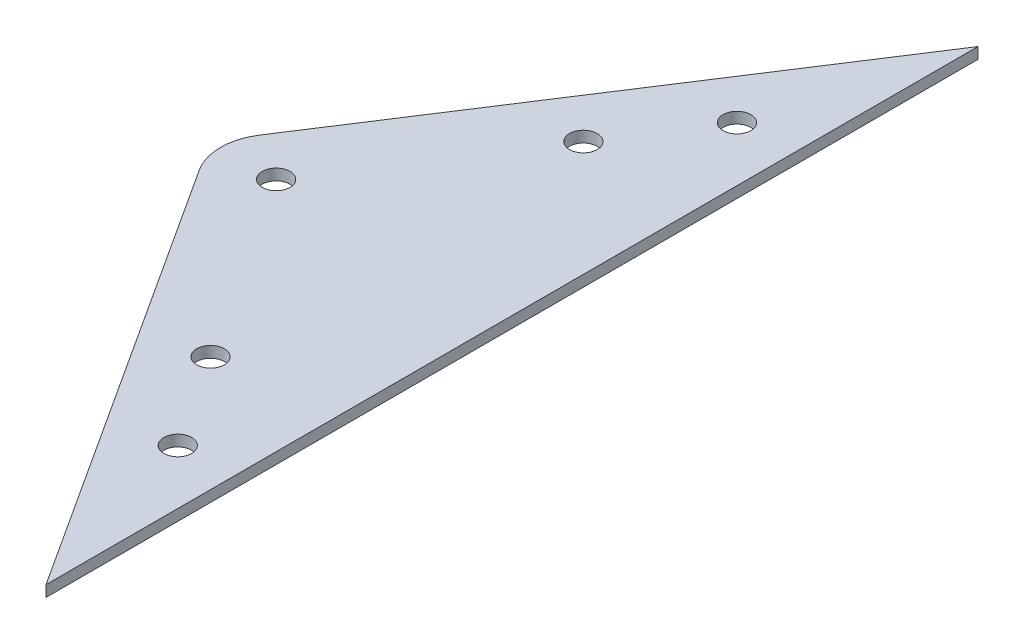
ISO-10303-21;
HEADER;
FILE_DESCRIPTION(('STEP AP214'),'2;1');
FILE_NAME('part.step','',(''),(''),'','','');
FILE_SCHEMA(('AUTOMOTIVE_DESIGN { 1 0 10303 214 1 1 1 1 }'));
ENDSEC;
DATA;
#1=APPLICATION_CONTEXT('core data for automotive mechanical design processes');
#2=APPLICATION_PROTOCOL_DEFINITION('international standard','automotive_design',2000,#1);
#3=PRODUCT_CONTEXT('',#1,'mechanical');
#4=PRODUCT('Part','Part','',(#3));
#5=PRODUCT_RELATED_PRODUCT_CATEGORY('part','',(#4));
#6=PRODUCT_DEFINITION_FORMATION('','',#4);
#7=PRODUCT_DEFINITION_CONTEXT('part definition',#1,'design');
#8=PRODUCT_DEFINITION('design','',#6,#7);
#9=PRODUCT_DEFINITION_SHAPE('','',#8);
#10=(LENGTH_UNIT() NAMED_UNIT(*) SI_UNIT(.MILLI.,.METRE.));
#11=(NAMED_UNIT(*) PLANE_ANGLE_UNIT() SI_UNIT($,.RADIAN.));
#12=(NAMED_UNIT(*) SI_UNIT($,.STERADIAN.) SOLID_ANGLE_UNIT());
#13=UNCERTAINTY_MEASURE_WITH_UNIT(LENGTH_MEASURE(1.E-05),#10,'distance_accuracy_value','');
#14=(GEOMETRIC_REPRESENTATION_CONTEXT(3) GLOBAL_UNCERTAINTY_ASSIGNED_CONTEXT((#13)) GLOBAL_UNIT_ASSIGNED_CONTEXT((#10,
#11,#12)) REPRESENTATION_CONTEXT('',''));
#15=CARTESIAN_POINT('',(0.,0.,0.));
#16=DIRECTION('',(0.,0.,1.));
#17=DIRECTION('',(1.,0.,0.));
#18=AXIS2_PLACEMENT_3D('',#15,#16,#17);
#19=CARTESIAN_POINT('',(72.122454047168,2.,378.693529571852));
#20=DIRECTION('',(0.,1.,0.));
#21=DIRECTION('',(0.,0.,1.));
#22=AXIS2_PLACEMENT_3D('',#19,#20,#21);
#23=PLANE('',#22);
#24=CARTESIAN_POINT('',(93.878732030658,2.,412.259351002365));
#25=DIRECTION('',(0.,1.,0.));
#26=DIRECTION('',(0.,0.,1.));
#27=AXIS2_PLACEMENT_3D('',#24,#25,#26);
#28=CIRCLE('',#27,2.50000000000004);
#29=CARTESIAN_POINT('',(93.878732030658,2.,414.759351002365));
#30=VERTEX_POINT('',#29);
#31=EDGE_CURVE('E127',#30,#30,#28,.T.);
#32=ORIENTED_EDGE('',*,*,#31,.F.);
#33=EDGE_LOOP('',(#32));
#34=FACE_BOUND('',#33,.T.);
#35=CARTESIAN_POINT('',(93.8787320306581,2.,345.127708141339));
#36=DIRECTION('',(0.,1.,0.));
#37=DIRECTION('',(0.,0.,1.));
#38=AXIS2_PLACEMENT_3D('',#35,#36,#37);
#39=CIRCLE('',#38,2.50000000000008);
#40=CARTESIAN_POINT('',(93.8787320306581,2.,347.627708141339));
#41=VERTEX_POINT('',#40);
#42=EDGE_CURVE('E115',#41,#41,#39,.T.);
#43=ORIENTED_EDGE('',*,*,#42,.F.);
#44=EDGE_LOOP('',(#43));
#45=FACE_BOUND('',#44,.T.);
#46=DIRECTION('',(0.,0.,-1.));
#47=VECTOR('',#46,1.);
#48=CARTESIAN_POINT('',(114.596265016384,2.,294.778975995569));
#49=LINE('',#48,#47);
#50=CARTESIAN_POINT('',(114.596265016384,2.,462.608083148135));
#51=VERTEX_POINT('',#50);
#52=CARTESIAN_POINT('',(114.596265016384,2.,294.778975995569));
#53=VERTEX_POINT('',#52);
#54=EDGE_CURVE('E85',#51,#53,#49,.T.);
#55=ORIENTED_EDGE('',*,*,#54,.T.);
#56=DIRECTION('',(-0.543906949587252,0.,0.839145535762832));
#57=VECTOR('',#56,1.);
#58=CARTESIAN_POINT('',(63.7309986895397,2.,373.25446007598));
#59=LINE('',#58,#57);
#60=CARTESIAN_POINT('',(63.7309986895397,2.,373.25446007598));
#61=VERTEX_POINT('',#60);
#62=EDGE_CURVE('E80',#53,#61,#59,.T.);
#63=ORIENTED_EDGE('',*,*,#62,.T.);
#64=CARTESIAN_POINT('',(72.122454047168,2.,378.693529571852));
#65=DIRECTION('',(0.,1.,0.));
#66=DIRECTION('',(0.,0.,1.));
#67=AXIS2_PLACEMENT_3D('',#64,#65,#66);
#68=CIRCLE('',#67,10.);
#69=CARTESIAN_POINT('',(63.7309986895397,2.,384.132599067725));
#70=VERTEX_POINT('',#69);
#71=EDGE_CURVE('E83',#61,#70,#68,.T.);
#72=ORIENTED_EDGE('',*,*,#71,.T.);
#73=DIRECTION('',(0.543906949587253,0.,0.839145535762832));
#74=VECTOR('',#73,1.);
#75=CARTESIAN_POINT('',(114.596265016384,2.,462.608083148135));
#76=LINE('',#75,#74);
#77=EDGE_CURVE('E50',#70,#51,#76,.T.);
#78=ORIENTED_EDGE('',*,*,#77,.T.);
#79=EDGE_LOOP('',(#55,#63,#72,#78));
#80=FACE_BOUND('',#79,.T.);
#81=CARTESIAN_POINT('',(72.122454047168,2.,378.693529571852));
#82=DIRECTION('',(0.,1.,0.));
#83=DIRECTION('',(0.,0.,1.));
#84=AXIS2_PLACEMENT_3D('',#81,#82,#83);
#85=CIRCLE('',#84,2.50000000000002);
#86=CARTESIAN_POINT('',(72.122454047168,2.,381.193529571852));
#87=VERTEX_POINT('',#86);
#88=EDGE_CURVE('E100',#87,#87,#85,.T.);
#89=ORIENTED_EDGE('',*,*,#88,.F.);
#90=EDGE_LOOP('',(#89));
#91=FACE_BOUND('',#90,.T.);
#92=CARTESIAN_POINT('',(104.756871022403,2.,328.344797426082));
#93=DIRECTION('',(0.,1.,0.));
#94=DIRECTION('',(0.,0.,1.));
#95=AXIS2_PLACEMENT_3D('',#92,#93,#94);
#96=CIRCLE('',#95,2.50000000000005);
#97=CARTESIAN_POINT('',(104.756871022403,2.,330.844797426082));
#98=VERTEX_POINT('',#97);
#99=EDGE_CURVE('E121',#98,#98,#96,.T.);
#100=ORIENTED_EDGE('',*,*,#99,.F.);
#101=EDGE_LOOP('',(#100));
#102=FACE_BOUND('',#101,.T.);
#103=CARTESIAN_POINT('',(104.756871022403,2.,429.042261717622));
#104=DIRECTION('',(0.,1.,0.));
#105=DIRECTION('',(0.,0.,1.));
#106=AXIS2_PLACEMENT_3D('',#103,#104,#105);
#107=CIRCLE('',#106,2.50000000000005);
#108=CARTESIAN_POINT('',(104.756871022403,2.,431.542261717622));
#109=VERTEX_POINT('',#108);
#110=EDGE_CURVE('E133',#109,#109,#107,.T.);
#111=ORIENTED_EDGE('',*,*,#110,.F.);
#112=EDGE_LOOP('',(#111));
#113=FACE_BOUND('',#112,.T.);
#114=ADVANCED_FACE('F33',(#34,#45,#80,#91,#102,#113),#23,.T.);
#115=CARTESIAN_POINT('',(72.122454047168,0.,378.693529571852));
#116=DIRECTION('',(0.,1.,0.));
#117=DIRECTION('',(0.,0.,1.));
#118=AXIS2_PLACEMENT_3D('',#115,#116,#117);
#119=PLANE('',#118);
#120=DIRECTION('',(0.,0.,-1.));
#121=VECTOR('',#120,1.);
#122=CARTESIAN_POINT('',(114.596265016384,0.,294.778975995569));
#123=LINE('',#122,#121);
#124=CARTESIAN_POINT('',(114.596265016384,0.,462.608083148135));
#125=VERTEX_POINT('',#124);
#126=CARTESIAN_POINT('',(114.596265016384,0.,294.778975995569));
#127=VERTEX_POINT('',#126);
#128=EDGE_CURVE('E97',#125,#127,#123,.T.);
#129=ORIENTED_EDGE('',*,*,#128,.F.);
#130=DIRECTION('',(0.543906949587253,0.,0.839145535762832));
#131=VECTOR('',#130,1.);
#132=CARTESIAN_POINT('',(114.596265016384,0.,462.608083148135));
#133=LINE('',#132,#131);
#134=CARTESIAN_POINT('',(63.7309986895397,0.,384.132599067725));
#135=VERTEX_POINT('',#134);
#136=EDGE_CURVE('E73',#135,#125,#133,.T.);
#137=ORIENTED_EDGE('',*,*,#136,.F.);
#138=CARTESIAN_POINT('',(72.122454047168,0.,378.693529571852));
#139=DIRECTION('',(0.,1.,0.));
#140=DIRECTION('',(0.,0.,1.));
#141=AXIS2_PLACEMENT_3D('',#138,#139,#140);
#142=CIRCLE('',#141,10.);
#143=CARTESIAN_POINT('',(63.7309986895397,0.,373.25446007598));
#144=VERTEX_POINT('',#143);
#145=EDGE_CURVE('E67',#144,#135,#142,.T.);
#146=ORIENTED_EDGE('',*,*,#145,.F.);
#147=DIRECTION('',(-0.543906949587252,0.,0.839145535762832));
#148=VECTOR('',#147,1.);
#149=CARTESIAN_POINT('',(63.7309986895397,0.,373.25446007598));
#150=LINE('',#149,#148);
#151=EDGE_CURVE('E89',#127,#144,#150,.T.);
#152=ORIENTED_EDGE('',*,*,#151,.F.);
#153=EDGE_LOOP('',(#129,#137,#146,#152));
#154=FACE_BOUND('',#153,.T.);
#155=CARTESIAN_POINT('',(72.122454047168,0.,378.693529571852));
#156=DIRECTION('',(0.,1.,0.));
#157=DIRECTION('',(0.,0.,1.));
#158=AXIS2_PLACEMENT_3D('',#155,#156,#157);
#159=CIRCLE('',#158,2.50000000000002);
#160=CARTESIAN_POINT('',(72.122454047168,0.,381.193529571852));
#161=VERTEX_POINT('',#160);
#162=EDGE_CURVE('E112',#161,#161,#159,.T.);
#163=ORIENTED_EDGE('',*,*,#162,.T.);
#164=EDGE_LOOP('',(#163));
#165=FACE_BOUND('',#164,.T.);
#166=CARTESIAN_POINT('',(93.8787320306581,0.,345.127708141339));
#167=DIRECTION('',(0.,1.,0.));
#168=DIRECTION('',(0.,0.,1.));
#169=AXIS2_PLACEMENT_3D('',#166,#167,#168);
#170=CIRCLE('',#169,2.50000000000008);
#171=CARTESIAN_POINT('',(93.8787320306581,0.,347.627708141339));
#172=VERTEX_POINT('',#171);
#173=EDGE_CURVE('E118',#172,#172,#170,.T.);
#174=ORIENTED_EDGE('',*,*,#173,.T.);
#175=EDGE_LOOP('',(#174));
#176=FACE_BOUND('',#175,.T.);
#177=CARTESIAN_POINT('',(104.756871022403,0.,328.344797426082));
#178=DIRECTION('',(0.,1.,0.));
#179=DIRECTION('',(0.,0.,1.));
#180=AXIS2_PLACEMENT_3D('',#177,#178,#179);
#181=CIRCLE('',#180,2.50000000000005);
#182=CARTESIAN_POINT('',(104.756871022403,0.,330.844797426082));
#183=VERTEX_POINT('',#182);
#184=EDGE_CURVE('E124',#183,#183,#181,.T.);
#185=ORIENTED_EDGE('',*,*,#184,.T.);
#186=EDGE_LOOP('',(#185));
#187=FACE_BOUND('',#186,.T.);
#188=CARTESIAN_POINT('',(93.878732030658,0.,412.259351002365));
#189=DIRECTION('',(0.,1.,0.));
#190=DIRECTION('',(0.,0.,1.));
#191=AXIS2_PLACEMENT_3D('',#188,#189,#190);
#192=CIRCLE('',#191,2.50000000000004);
#193=CARTESIAN_POINT('',(93.878732030658,0.,414.759351002365));
#194=VERTEX_POINT('',#193);
#195=EDGE_CURVE('E130',#194,#194,#192,.T.);
#196=ORIENTED_EDGE('',*,*,#195,.T.);
#197=EDGE_LOOP('',(#196));
#198=FACE_BOUND('',#197,.T.);
#199=CARTESIAN_POINT('',(104.756871022403,0.,429.042261717622));
#200=DIRECTION('',(0.,1.,0.));
#201=DIRECTION('',(0.,0.,1.));
#202=AXIS2_PLACEMENT_3D('',#199,#200,#201);
#203=CIRCLE('',#202,2.50000000000005);
#204=CARTESIAN_POINT('',(104.756871022403,0.,431.542261717622));
#205=VERTEX_POINT('',#204);
#206=EDGE_CURVE('E136',#205,#205,#203,.T.);
#207=ORIENTED_EDGE('',*,*,#206,.T.);
#208=EDGE_LOOP('',(#207));
#209=FACE_BOUND('',#208,.T.);
#210=ADVANCED_FACE('F108',(#154,#165,#176,#187,#198,#209),#119,.F.);
#211=CARTESIAN_POINT('',(114.596265016384,2.,294.778975995569));
#212=DIRECTION('',(-1.,0.,0.));
#213=DIRECTION('',(0.,0.,1.));
#214=AXIS2_PLACEMENT_3D('',#211,#212,#213);
#215=PLANE('',#214);
#216=ORIENTED_EDGE('',*,*,#128,.T.);
#217=DIRECTION('',(0.,-1.,0.));
#218=VECTOR('',#217,1.);
#219=CARTESIAN_POINT('',(114.596265016384,2.,294.778975995569));
#220=LINE('',#219,#218);
#221=EDGE_CURVE('E11',#53,#127,#220,.T.);
#222=ORIENTED_EDGE('',*,*,#221,.F.);
#223=ORIENTED_EDGE('',*,*,#54,.F.);
#224=DIRECTION('',(0.,-1.,0.));
#225=VECTOR('',#224,1.);
#226=CARTESIAN_POINT('',(114.596265016384,2.,462.608083148135));
#227=LINE('',#226,#225);
#228=EDGE_CURVE('E93',#51,#125,#227,.T.);
#229=ORIENTED_EDGE('',*,*,#228,.T.);
#230=EDGE_LOOP('',(#216,#222,#223,#229));
#231=FACE_BOUND('',#230,.T.);
#232=ADVANCED_FACE('F35',(#231),#215,.F.);
#233=CARTESIAN_POINT('',(63.7309986895397,2.,373.25446007598));
#234=DIRECTION('',(0.839145535762832,0.,0.543906949587252));
#235=DIRECTION('',(0.543906949587252,0.,-0.839145535762832));
#236=AXIS2_PLACEMENT_3D('',#233,#234,#235);
#237=PLANE('',#236);
#238=ORIENTED_EDGE('',*,*,#151,.T.);
#239=DIRECTION('',(0.,-1.,0.));
#240=VECTOR('',#239,1.);
#241=CARTESIAN_POINT('',(63.7309986895397,2.,373.25446007598));
#242=LINE('',#241,#240);
#243=EDGE_CURVE('E42',#61,#144,#242,.T.);
#244=ORIENTED_EDGE('',*,*,#243,.F.);
#245=ORIENTED_EDGE('',*,*,#62,.F.);
#246=ORIENTED_EDGE('',*,*,#221,.T.);
#247=EDGE_LOOP('',(#238,#244,#245,#246));
#248=FACE_BOUND('',#247,.T.);
#249=ADVANCED_FACE('F88',(#248),#237,.F.);
#250=CARTESIAN_POINT('',(72.122454047168,2.,378.693529571852));
#251=DIRECTION('',(0.,-1.,0.));
#252=DIRECTION('',(0.,0.,-1.));
#253=AXIS2_PLACEMENT_3D('',#250,#251,#252);
#254=CYLINDRICAL_SURFACE('',#253,10.);
#255=ORIENTED_EDGE('',*,*,#145,.T.);
#256=DIRECTION('',(0.,-1.,0.));
#257=VECTOR('',#256,1.);
#258=CARTESIAN_POINT('',(63.7309986895397,2.,384.132599067725));
#259=LINE('',#258,#257);
#260=EDGE_CURVE('E90',#70,#135,#259,.T.);
#261=ORIENTED_EDGE('',*,*,#260,.F.);
#262=ORIENTED_EDGE('',*,*,#71,.F.);
#263=ORIENTED_EDGE('',*,*,#243,.T.);
#264=EDGE_LOOP('',(#255,#261,#262,#263));
#265=FACE_BOUND('',#264,.T.);
#266=ADVANCED_FACE('F91',(#265),#254,.T.);
#267=CARTESIAN_POINT('',(114.596265016384,2.,462.608083148135));
#268=DIRECTION('',(0.839145535762832,0.,-0.543906949587253));
#269=DIRECTION('',(-0.543906949587253,0.,-0.839145535762832));
#270=AXIS2_PLACEMENT_3D('',#267,#268,#269);
#271=PLANE('',#270);
#272=ORIENTED_EDGE('',*,*,#136,.T.);
#273=ORIENTED_EDGE('',*,*,#228,.F.);
#274=ORIENTED_EDGE('',*,*,#77,.F.);
#275=ORIENTED_EDGE('',*,*,#260,.T.);
#276=EDGE_LOOP('',(#272,#273,#274,#275));
#277=FACE_BOUND('',#276,.T.);
#278=ADVANCED_FACE('F105',(#277),#271,.F.);
#279=CARTESIAN_POINT('',(72.122454047168,2.,378.693529571852));
#280=DIRECTION('',(0.,-1.,0.));
#281=DIRECTION('',(0.,0.,-1.));
#282=AXIS2_PLACEMENT_3D('',#279,#280,#281);
#283=CYLINDRICAL_SURFACE('',#282,2.50000000000002);
#284=ORIENTED_EDGE('',*,*,#88,.T.);
#285=EDGE_LOOP('',(#284));
#286=FACE_BOUND('',#285,.T.);
#287=ORIENTED_EDGE('',*,*,#162,.F.);
#288=EDGE_LOOP('',(#287));
#289=FACE_BOUND('',#288,.T.);
#290=ADVANCED_FACE('F155',(#286,#289),#283,.F.);
#291=CARTESIAN_POINT('',(93.8787320306581,2.,345.127708141339));
#292=DIRECTION('',(0.,-1.,0.));
#293=DIRECTION('',(0.,0.,-1.));
#294=AXIS2_PLACEMENT_3D('',#291,#292,#293);
#295=CYLINDRICAL_SURFACE('',#294,2.50000000000008);
#296=ORIENTED_EDGE('',*,*,#42,.T.);
#297=EDGE_LOOP('',(#296));
#298=FACE_BOUND('',#297,.T.);
#299=ORIENTED_EDGE('',*,*,#173,.F.);
#300=EDGE_LOOP('',(#299));
#301=FACE_BOUND('',#300,.T.);
#302=ADVANCED_FACE('F201',(#298,#301),#295,.F.);
#303=CARTESIAN_POINT('',(104.756871022403,2.,328.344797426082));
#304=DIRECTION('',(0.,-1.,0.));
#305=DIRECTION('',(0.,0.,-1.));
#306=AXIS2_PLACEMENT_3D('',#303,#304,#305);
#307=CYLINDRICAL_SURFACE('',#306,2.50000000000005);
#308=ORIENTED_EDGE('',*,*,#99,.T.);
#309=EDGE_LOOP('',(#308));
#310=FACE_BOUND('',#309,.T.);
#311=ORIENTED_EDGE('',*,*,#184,.F.);
#312=EDGE_LOOP('',(#311));
#313=FACE_BOUND('',#312,.T.);
#314=ADVANCED_FACE('F209',(#310,#313),#307,.F.);
#315=CARTESIAN_POINT('',(93.878732030658,2.,412.259351002365));
#316=DIRECTION('',(0.,-1.,0.));
#317=DIRECTION('',(0.,0.,-1.));
#318=AXIS2_PLACEMENT_3D('',#315,#316,#317);
#319=CYLINDRICAL_SURFACE('',#318,2.50000000000004);
#320=ORIENTED_EDGE('',*,*,#31,.T.);
#321=EDGE_LOOP('',(#320));
#322=FACE_BOUND('',#321,.T.);
#323=ORIENTED_EDGE('',*,*,#195,.F.);
#324=EDGE_LOOP('',(#323));
#325=FACE_BOUND('',#324,.T.);
#326=ADVANCED_FACE('F217',(#322,#325),#319,.F.);
#327=CARTESIAN_POINT('',(104.756871022403,2.,429.042261717622));
#328=DIRECTION('',(0.,-1.,0.));
#329=DIRECTION('',(0.,0.,-1.));
#330=AXIS2_PLACEMENT_3D('',#327,#328,#329);
#331=CYLINDRICAL_SURFACE('',#330,2.50000000000005);
#332=ORIENTED_EDGE('',*,*,#110,.T.);
#333=EDGE_LOOP('',(#332));
#334=FACE_BOUND('',#333,.T.);
#335=ORIENTED_EDGE('',*,*,#206,.F.);
#336=EDGE_LOOP('',(#335));
#337=FACE_BOUND('',#336,.T.);
#338=ADVANCED_FACE('F142',(#334,#337),#331,.F.);
#339=CLOSED_SHELL('',(#114,#210,#232,#249,#266,#278,#290,#302,#314,#326,#338));
#340=MANIFOLD_SOLID_BREP('B2',#339);
#341=ADVANCED_BREP_SHAPE_REPRESENTATION('',(#18,#340),#14);
#342=SHAPE_DEFINITION_REPRESENTATION(#9,#341);
ENDSEC;
END-ISO-10303-21;
